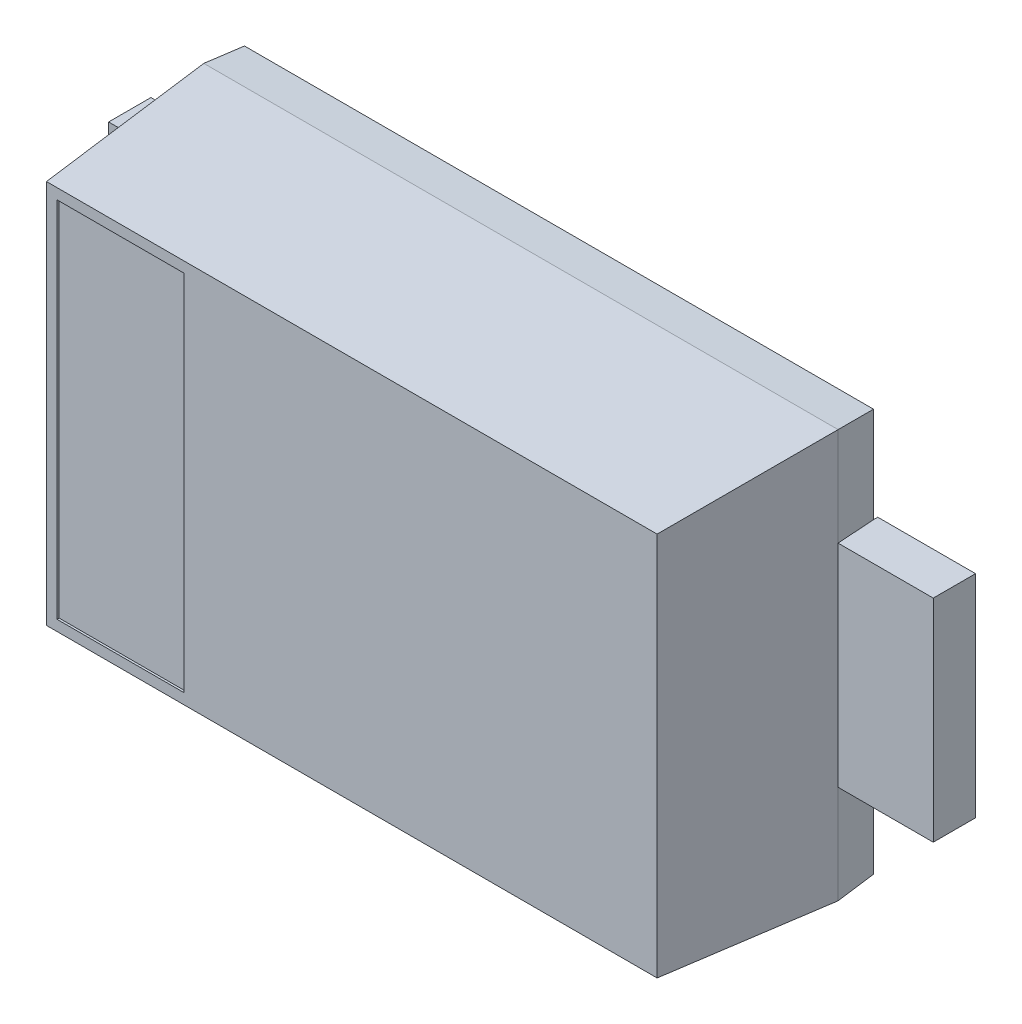
ISO-10303-21;
HEADER;
FILE_DESCRIPTION(('STEP AP214'),'2;1');
FILE_NAME('part.step','',(''),(''),'','','');
FILE_SCHEMA(('AUTOMOTIVE_DESIGN { 1 0 10303 214 1 1 1 1 }'));
ENDSEC;
DATA;
#1=APPLICATION_CONTEXT('core data for automotive mechanical design processes');
#2=APPLICATION_PROTOCOL_DEFINITION('international standard','automotive_design',2000,#1);
#3=PRODUCT_CONTEXT('',#1,'mechanical');
#4=PRODUCT('Part','Part','',(#3));
#5=PRODUCT_RELATED_PRODUCT_CATEGORY('part','',(#4));
#6=PRODUCT_DEFINITION_FORMATION('','',#4);
#7=PRODUCT_DEFINITION_CONTEXT('part definition',#1,'design');
#8=PRODUCT_DEFINITION('design','',#6,#7);
#9=PRODUCT_DEFINITION_SHAPE('','',#8);
#10=(LENGTH_UNIT() NAMED_UNIT(*) SI_UNIT(.MILLI.,.METRE.));
#11=(NAMED_UNIT(*) PLANE_ANGLE_UNIT() SI_UNIT($,.RADIAN.));
#12=(NAMED_UNIT(*) SI_UNIT($,.STERADIAN.) SOLID_ANGLE_UNIT());
#13=UNCERTAINTY_MEASURE_WITH_UNIT(LENGTH_MEASURE(1.E-05),#10,'distance_accuracy_value','');
#14=(GEOMETRIC_REPRESENTATION_CONTEXT(3) GLOBAL_UNCERTAINTY_ASSIGNED_CONTEXT((#13)) GLOBAL_UNIT_ASSIGNED_CONTEXT((#10,
#11,#12)) REPRESENTATION_CONTEXT('',''));
#15=CARTESIAN_POINT('',(0.,0.,0.));
#16=DIRECTION('',(0.,0.,1.));
#17=DIRECTION('',(1.,0.,0.));
#18=AXIS2_PLACEMENT_3D('',#15,#16,#17);
#19=CARTESIAN_POINT('',(-1.035765418923,0.,0.));
#20=DIRECTION('',(0.,0.,-1.));
#21=DIRECTION('',(-1.,0.,0.));
#22=AXIS2_PLACEMENT_3D('',#19,#20,#21);
#23=PLANE('',#22);
#24=DIRECTION('',(0.,1.,0.));
#25=VECTOR('',#24,1.);
#26=CARTESIAN_POINT('',(-0.13741317385,-0.55,0.));
#27=LINE('',#26,#25);
#28=CARTESIAN_POINT('',(-0.13741317385,-0.55,0.));
#29=VERTEX_POINT('',#28);
#30=CARTESIAN_POINT('',(-0.13741317385,0.55,0.));
#31=VERTEX_POINT('',#30);
#32=EDGE_CURVE('E306',#29,#31,#27,.T.);
#33=ORIENTED_EDGE('',*,*,#32,.F.);
#34=DIRECTION('',(1.,0.,0.));
#35=VECTOR('',#34,1.);
#36=CARTESIAN_POINT('',(-1.48741317385,-0.55,0.));
#37=LINE('',#36,#35);
#38=CARTESIAN_POINT('',(-1.48741317385,-0.55,0.));
#39=VERTEX_POINT('',#38);
#40=EDGE_CURVE('E307',#29,#39,#37,.F.);
#41=ORIENTED_EDGE('',*,*,#40,.T.);
#42=DIRECTION('',(0.,1.,0.));
#43=VECTOR('',#42,1.);
#44=CARTESIAN_POINT('',(-1.48741317385,0.,0.));
#45=LINE('',#44,#43);
#46=CARTESIAN_POINT('',(-1.48741317385,-0.5,0.));
#47=VERTEX_POINT('',#46);
#48=EDGE_CURVE('E336',#39,#47,#45,.T.);
#49=ORIENTED_EDGE('',*,*,#48,.T.);
#50=DIRECTION('',(-1.,0.,0.));
#51=VECTOR('',#50,1.);
#52=CARTESIAN_POINT('',(-1.035765418923,-0.5,0.));
#53=LINE('',#52,#51);
#54=CARTESIAN_POINT('',(-1.95,-0.5,0.));
#55=VERTEX_POINT('',#54);
#56=EDGE_CURVE('E327',#47,#55,#53,.T.);
#57=ORIENTED_EDGE('',*,*,#56,.T.);
#58=DIRECTION('',(0.,-1.,0.));
#59=VECTOR('',#58,1.);
#60=CARTESIAN_POINT('',(-1.95,0.5,0.));
#61=LINE('',#60,#59);
#62=CARTESIAN_POINT('',(-1.95,0.5,0.));
#63=VERTEX_POINT('',#62);
#64=EDGE_CURVE('E330',#63,#55,#61,.T.);
#65=ORIENTED_EDGE('',*,*,#64,.F.);
#66=DIRECTION('',(1.,0.,0.));
#67=VECTOR('',#66,1.);
#68=CARTESIAN_POINT('',(-1.48741317385,0.5,0.));
#69=LINE('',#68,#67);
#70=CARTESIAN_POINT('',(-1.48741317385,0.5,0.));
#71=VERTEX_POINT('',#70);
#72=EDGE_CURVE('E197',#63,#71,#69,.T.);
#73=ORIENTED_EDGE('',*,*,#72,.T.);
#74=DIRECTION('',(0.,1.,0.));
#75=VECTOR('',#74,1.);
#76=CARTESIAN_POINT('',(-1.48741317385,-0.55,0.));
#77=LINE('',#76,#75);
#78=CARTESIAN_POINT('',(-1.48741317385,0.55,0.));
#79=VERTEX_POINT('',#78);
#80=EDGE_CURVE('E193',#71,#79,#77,.T.);
#81=ORIENTED_EDGE('',*,*,#80,.T.);
#82=DIRECTION('',(1.,0.,0.));
#83=VECTOR('',#82,1.);
#84=CARTESIAN_POINT('',(-1.48741317385,0.55,0.));
#85=LINE('',#84,#83);
#86=EDGE_CURVE('E296',#31,#79,#85,.F.);
#87=ORIENTED_EDGE('',*,*,#86,.F.);
#88=EDGE_LOOP('',(#33,#41,#49,#57,#65,#73,#81,#87));
#89=FACE_BOUND('',#88,.T.);
#90=ADVANCED_FACE('F17',(#89),#23,.T.);
#91=CARTESIAN_POINT('',(-1.48741317385,-0.55,0.));
#92=DIRECTION('',(0.,1.,0.));
#93=DIRECTION('',(0.,0.,1.));
#94=AXIS2_PLACEMENT_3D('',#91,#92,#93);
#95=PLANE('',#94);
#96=DIRECTION('',(-1.,0.,0.));
#97=VECTOR('',#96,1.);
#98=CARTESIAN_POINT('',(-1.48741317385,-0.55,0.02));
#99=LINE('',#98,#97);
#100=CARTESIAN_POINT('',(-1.48741317385,-0.55,0.02));
#101=VERTEX_POINT('',#100);
#102=CARTESIAN_POINT('',(-0.13741317385,-0.55,0.02));
#103=VERTEX_POINT('',#102);
#104=EDGE_CURVE('E300',#101,#103,#99,.F.);
#105=ORIENTED_EDGE('',*,*,#104,.F.);
#106=DIRECTION('',(0.,0.,-1.));
#107=VECTOR('',#106,1.);
#108=CARTESIAN_POINT('',(-1.48741317385,-0.55,0.));
#109=LINE('',#108,#107);
#110=EDGE_CURVE('E314',#101,#39,#109,.T.);
#111=ORIENTED_EDGE('',*,*,#110,.T.);
#112=ORIENTED_EDGE('',*,*,#40,.F.);
#113=DIRECTION('',(0.,0.,-1.));
#114=VECTOR('',#113,1.);
#115=CARTESIAN_POINT('',(-0.13741317385,-0.55,0.));
#116=LINE('',#115,#114);
#117=EDGE_CURVE('E303',#103,#29,#116,.T.);
#118=ORIENTED_EDGE('',*,*,#117,.F.);
#119=EDGE_LOOP('',(#105,#111,#112,#118));
#120=FACE_BOUND('',#119,.T.);
#121=ADVANCED_FACE('F613',(#120),#95,.F.);
#122=CARTESIAN_POINT('',(-0.13741317385,-0.55,0.));
#123=DIRECTION('',(1.,0.,0.));
#124=DIRECTION('',(0.,0.,-1.));
#125=AXIS2_PLACEMENT_3D('',#122,#123,#124);
#126=PLANE('',#125);
#127=DIRECTION('',(0.,0.,1.));
#128=VECTOR('',#127,1.);
#129=CARTESIAN_POINT('',(-0.13741317385,0.55,0.));
#130=LINE('',#129,#128);
#131=CARTESIAN_POINT('',(-0.13741317385,0.55,0.02));
#132=VERTEX_POINT('',#131);
#133=EDGE_CURVE('E250',#132,#31,#130,.F.);
#134=ORIENTED_EDGE('',*,*,#133,.F.);
#135=DIRECTION('',(0.,1.,0.));
#136=VECTOR('',#135,1.);
#137=CARTESIAN_POINT('',(-0.13741317385,-0.95241317385,0.02));
#138=LINE('',#137,#136);
#139=EDGE_CURVE('E234',#103,#132,#138,.T.);
#140=ORIENTED_EDGE('',*,*,#139,.F.);
#141=ORIENTED_EDGE('',*,*,#117,.T.);
#142=ORIENTED_EDGE('',*,*,#32,.T.);
#143=EDGE_LOOP('',(#134,#140,#141,#142));
#144=FACE_BOUND('',#143,.T.);
#145=ADVANCED_FACE('F609',(#144),#126,.T.);
#146=CARTESIAN_POINT('',(-1.48741317385,0.55,0.));
#147=DIRECTION('',(0.,1.,0.));
#148=DIRECTION('',(0.,0.,1.));
#149=AXIS2_PLACEMENT_3D('',#146,#147,#148);
#150=PLANE('',#149);
#151=DIRECTION('',(-1.,0.,0.));
#152=VECTOR('',#151,1.);
#153=CARTESIAN_POINT('',(-1.48741317385,0.55,0.02));
#154=LINE('',#153,#152);
#155=CARTESIAN_POINT('',(-1.48741317385,0.55,0.02));
#156=VERTEX_POINT('',#155);
#157=EDGE_CURVE('E231',#132,#156,#154,.T.);
#158=ORIENTED_EDGE('',*,*,#157,.F.);
#159=ORIENTED_EDGE('',*,*,#133,.T.);
#160=ORIENTED_EDGE('',*,*,#86,.T.);
#161=DIRECTION('',(0.,0.,-1.));
#162=VECTOR('',#161,1.);
#163=CARTESIAN_POINT('',(-1.48741317385,0.55,0.));
#164=LINE('',#163,#162);
#165=EDGE_CURVE('E223',#79,#156,#164,.F.);
#166=ORIENTED_EDGE('',*,*,#165,.T.);
#167=EDGE_LOOP('',(#158,#159,#160,#166));
#168=FACE_BOUND('',#167,.T.);
#169=ADVANCED_FACE('F605',(#168),#150,.T.);
#170=CARTESIAN_POINT('',(1.48741317385,-0.5,0.));
#171=DIRECTION('',(0.,0.,1.));
#172=DIRECTION('',(1.,0.,0.));
#173=AXIS2_PLACEMENT_3D('',#170,#171,#172);
#174=PLANE('',#173);
#175=DIRECTION('',(0.,1.,0.));
#176=VECTOR('',#175,1.);
#177=CARTESIAN_POINT('',(1.95,-0.5,0.));
#178=LINE('',#177,#176);
#179=CARTESIAN_POINT('',(1.95,-0.5,0.));
#180=VERTEX_POINT('',#179);
#181=CARTESIAN_POINT('',(1.95,0.5,0.));
#182=VERTEX_POINT('',#181);
#183=EDGE_CURVE('E259',#180,#182,#178,.T.);
#184=ORIENTED_EDGE('',*,*,#183,.F.);
#185=DIRECTION('',(-1.,0.,0.));
#186=VECTOR('',#185,1.);
#187=CARTESIAN_POINT('',(1.48741317385,-0.5,0.));
#188=LINE('',#187,#186);
#189=CARTESIAN_POINT('',(1.48741317385,-0.5,0.));
#190=VERTEX_POINT('',#189);
#191=EDGE_CURVE('E264',#180,#190,#188,.T.);
#192=ORIENTED_EDGE('',*,*,#191,.T.);
#193=DIRECTION('',(0.,1.,0.));
#194=VECTOR('',#193,1.);
#195=CARTESIAN_POINT('',(1.48741317385,-0.5,0.));
#196=LINE('',#195,#194);
#197=CARTESIAN_POINT('',(1.48741317385,0.5,0.));
#198=VERTEX_POINT('',#197);
#199=EDGE_CURVE('E247',#190,#198,#196,.T.);
#200=ORIENTED_EDGE('',*,*,#199,.T.);
#201=DIRECTION('',(-1.,0.,0.));
#202=VECTOR('',#201,1.);
#203=CARTESIAN_POINT('',(1.48741317385,0.5,0.));
#204=LINE('',#203,#202);
#205=EDGE_CURVE('E253',#182,#198,#204,.T.);
#206=ORIENTED_EDGE('',*,*,#205,.F.);
#207=EDGE_LOOP('',(#184,#192,#200,#206));
#208=FACE_BOUND('',#207,.T.);
#209=ADVANCED_FACE('F602',(#208),#174,.F.);
#210=CARTESIAN_POINT('',(1.48741317385,-0.5,0.));
#211=DIRECTION('',(1.,0.,0.));
#212=DIRECTION('',(0.,1.,0.));
#213=AXIS2_PLACEMENT_3D('',#210,#211,#212);
#214=PLANE('',#213);
#215=DIRECTION('',(0.,0.,1.));
#216=VECTOR('',#215,1.);
#217=CARTESIAN_POINT('',(1.48741317385,0.5,0.));
#218=LINE('',#217,#216);
#219=CARTESIAN_POINT('',(1.48741317385,0.5,0.02));
#220=VERTEX_POINT('',#219);
#221=EDGE_CURVE('E255',#198,#220,#218,.T.);
#222=ORIENTED_EDGE('',*,*,#221,.F.);
#223=ORIENTED_EDGE('',*,*,#199,.F.);
#224=DIRECTION('',(0.,0.,1.));
#225=VECTOR('',#224,1.);
#226=CARTESIAN_POINT('',(1.48741317385,-0.5,0.));
#227=LINE('',#226,#225);
#228=CARTESIAN_POINT('',(1.48741317385,-0.5,0.02));
#229=VERTEX_POINT('',#228);
#230=EDGE_CURVE('E267',#190,#229,#227,.T.);
#231=ORIENTED_EDGE('',*,*,#230,.T.);
#232=DIRECTION('',(0.,1.,0.));
#233=VECTOR('',#232,1.);
#234=CARTESIAN_POINT('',(1.48741317385,-0.95241317385,0.02));
#235=LINE('',#234,#233);
#236=EDGE_CURVE('E271',#220,#229,#235,.F.);
#237=ORIENTED_EDGE('',*,*,#236,.F.);
#238=EDGE_LOOP('',(#222,#223,#231,#237));
#239=FACE_BOUND('',#238,.T.);
#240=ADVANCED_FACE('F466',(#239),#214,.F.);
#241=CARTESIAN_POINT('',(-1.48741317385,-0.55,0.));
#242=DIRECTION('',(1.,0.,0.));
#243=DIRECTION('',(0.,0.,-1.));
#244=AXIS2_PLACEMENT_3D('',#241,#242,#243);
#245=PLANE('',#244);
#246=ORIENTED_EDGE('',*,*,#80,.F.);
#247=DIRECTION('',(0.,0.,1.));
#248=VECTOR('',#247,1.);
#249=CARTESIAN_POINT('',(-1.48741317385,0.5,0.));
#250=LINE('',#249,#248);
#251=CARTESIAN_POINT('',(-1.48741317385,0.5,0.0200000000000003));
#252=VERTEX_POINT('',#251);
#253=EDGE_CURVE('E190',#71,#252,#250,.T.);
#254=ORIENTED_EDGE('',*,*,#253,.T.);
#255=DIRECTION('',(0.,-1.,0.));
#256=VECTOR('',#255,1.);
#257=CARTESIAN_POINT('',(-1.48741317385,0.,0.02));
#258=LINE('',#257,#256);
#259=EDGE_CURVE('E176',#156,#252,#258,.T.);
#260=ORIENTED_EDGE('',*,*,#259,.F.);
#261=ORIENTED_EDGE('',*,*,#165,.F.);
#262=EDGE_LOOP('',(#246,#254,#260,#261));
#263=FACE_BOUND('',#262,.T.);
#264=ADVANCED_FACE('F191',(#263),#245,.F.);
#265=CARTESIAN_POINT('',(-1.48741317385,0.5,0.));
#266=DIRECTION('',(0.,-1.,0.));
#267=DIRECTION('',(1.,0.,0.));
#268=AXIS2_PLACEMENT_3D('',#265,#266,#267);
#269=PLANE('',#268);
#270=DIRECTION('',(-0.0697564737450522,0.,0.997564050259759));
#271=VECTOR('',#270,1.);
#272=CARTESIAN_POINT('',(-1.48741317385,0.5,0.02));
#273=LINE('',#272,#271);
#274=CARTESIAN_POINT('',(-1.5,0.5,0.2));
#275=VERTEX_POINT('',#274);
#276=EDGE_CURVE('E21',#252,#275,#273,.T.);
#277=ORIENTED_EDGE('',*,*,#276,.F.);
#278=ORIENTED_EDGE('',*,*,#253,.F.);
#279=ORIENTED_EDGE('',*,*,#72,.F.);
#280=DIRECTION('',(0.,0.,1.));
#281=VECTOR('',#280,1.);
#282=CARTESIAN_POINT('',(-1.95,0.5,0.));
#283=LINE('',#282,#281);
#284=CARTESIAN_POINT('',(-1.95,0.5,0.2));
#285=VERTEX_POINT('',#284);
#286=EDGE_CURVE('E196',#285,#63,#283,.F.);
#287=ORIENTED_EDGE('',*,*,#286,.F.);
#288=DIRECTION('',(1.,0.,0.));
#289=VECTOR('',#288,1.);
#290=CARTESIAN_POINT('',(-1.48741317385,0.5,0.2));
#291=LINE('',#290,#289);
#292=EDGE_CURVE('E202',#275,#285,#291,.F.);
#293=ORIENTED_EDGE('',*,*,#292,.F.);
#294=EDGE_LOOP('',(#277,#278,#279,#287,#293));
#295=FACE_BOUND('',#294,.T.);
#296=ADVANCED_FACE('F200',(#295),#269,.F.);
#297=CARTESIAN_POINT('',(-1.95,0.5,0.));
#298=DIRECTION('',(-1.,0.,0.));
#299=DIRECTION('',(0.,-1.,0.));
#300=AXIS2_PLACEMENT_3D('',#297,#298,#299);
#301=PLANE('',#300);
#302=DIRECTION('',(0.,0.,1.));
#303=VECTOR('',#302,1.);
#304=CARTESIAN_POINT('',(-1.95,-0.5,0.));
#305=LINE('',#304,#303);
#306=CARTESIAN_POINT('',(-1.95,-0.5,0.2));
#307=VERTEX_POINT('',#306);
#308=EDGE_CURVE('E317',#307,#55,#305,.F.);
#309=ORIENTED_EDGE('',*,*,#308,.F.);
#310=DIRECTION('',(0.,1.,0.));
#311=VECTOR('',#310,1.);
#312=CARTESIAN_POINT('',(-1.95,0.5,0.2));
#313=LINE('',#312,#311);
#314=EDGE_CURVE('E204',#285,#307,#313,.F.);
#315=ORIENTED_EDGE('',*,*,#314,.F.);
#316=ORIENTED_EDGE('',*,*,#286,.T.);
#317=ORIENTED_EDGE('',*,*,#64,.T.);
#318=EDGE_LOOP('',(#309,#315,#316,#317));
#319=FACE_BOUND('',#318,.T.);
#320=ADVANCED_FACE('F392',(#319),#301,.T.);
#321=CARTESIAN_POINT('',(-1.48741317385,-0.5,0.));
#322=DIRECTION('',(0.,-1.,0.));
#323=DIRECTION('',(1.,0.,0.));
#324=AXIS2_PLACEMENT_3D('',#321,#322,#323);
#325=PLANE('',#324);
#326=DIRECTION('',(-0.0697564737450522,0.,0.997564050259759));
#327=VECTOR('',#326,1.);
#328=CARTESIAN_POINT('',(-1.48741317385,-0.5,0.02));
#329=LINE('',#328,#327);
#330=CARTESIAN_POINT('',(-1.5,-0.5,0.2));
#331=VERTEX_POINT('',#330);
#332=CARTESIAN_POINT('',(-1.48741317385,-0.5,0.02));
#333=VERTEX_POINT('',#332);
#334=EDGE_CURVE('E358',#331,#333,#329,.F.);
#335=ORIENTED_EDGE('',*,*,#334,.F.);
#336=DIRECTION('',(1.,0.,0.));
#337=VECTOR('',#336,1.);
#338=CARTESIAN_POINT('',(-1.48741317385,-0.5,0.2));
#339=LINE('',#338,#337);
#340=EDGE_CURVE('E207',#307,#331,#339,.T.);
#341=ORIENTED_EDGE('',*,*,#340,.F.);
#342=ORIENTED_EDGE('',*,*,#308,.T.);
#343=ORIENTED_EDGE('',*,*,#56,.F.);
#344=DIRECTION('',(0.,0.,-1.));
#345=VECTOR('',#344,1.);
#346=CARTESIAN_POINT('',(-1.48741317385,-0.5,0.));
#347=LINE('',#346,#345);
#348=EDGE_CURVE('E311',#47,#333,#347,.F.);
#349=ORIENTED_EDGE('',*,*,#348,.T.);
#350=EDGE_LOOP('',(#335,#341,#342,#343,#349));
#351=FACE_BOUND('',#350,.T.);
#352=ADVANCED_FACE('F398',(#351),#325,.T.);
#353=CARTESIAN_POINT('',(-1.48741317385,-0.55,0.));
#354=DIRECTION('',(1.,0.,0.));
#355=DIRECTION('',(0.,0.,-1.));
#356=AXIS2_PLACEMENT_3D('',#353,#354,#355);
#357=PLANE('',#356);
#358=ORIENTED_EDGE('',*,*,#48,.F.);
#359=ORIENTED_EDGE('',*,*,#110,.F.);
#360=DIRECTION('',(0.,-1.,0.));
#361=VECTOR('',#360,1.);
#362=CARTESIAN_POINT('',(-1.48741317385,0.,0.02));
#363=LINE('',#362,#361);
#364=EDGE_CURVE('E322',#333,#101,#363,.T.);
#365=ORIENTED_EDGE('',*,*,#364,.F.);
#366=ORIENTED_EDGE('',*,*,#348,.F.);
#367=EDGE_LOOP('',(#358,#359,#365,#366));
#368=FACE_BOUND('',#367,.T.);
#369=ADVANCED_FACE('F588',(#368),#357,.F.);
#370=CARTESIAN_POINT('',(-1.48741317385,-0.95241317385,0.02));
#371=DIRECTION('',(0.,0.,-1.));
#372=DIRECTION('',(-1.,0.,0.));
#373=AXIS2_PLACEMENT_3D('',#370,#371,#372);
#374=PLANE('',#373);
#375=ORIENTED_EDGE('',*,*,#236,.T.);
#376=DIRECTION('',(0.,1.,0.));
#377=VECTOR('',#376,1.);
#378=CARTESIAN_POINT('',(1.48741317385,-0.95241317385,0.02));
#379=LINE('',#378,#377);
#380=CARTESIAN_POINT('',(1.48741317385,-0.95241317385,0.02));
#381=VERTEX_POINT('',#380);
#382=EDGE_CURVE('E268',#229,#381,#379,.F.);
#383=ORIENTED_EDGE('',*,*,#382,.T.);
#384=DIRECTION('',(1.,0.,0.));
#385=VECTOR('',#384,1.);
#386=CARTESIAN_POINT('',(0.,-0.95241317385,0.02));
#387=LINE('',#386,#385);
#388=CARTESIAN_POINT('',(-1.48741317385,-0.95241317385,0.02));
#389=VERTEX_POINT('',#388);
#390=EDGE_CURVE('E228',#389,#381,#387,.T.);
#391=ORIENTED_EDGE('',*,*,#390,.F.);
#392=DIRECTION('',(0.,-1.,0.));
#393=VECTOR('',#392,1.);
#394=CARTESIAN_POINT('',(-1.48741317385,0.,0.02));
#395=LINE('',#394,#393);
#396=EDGE_CURVE('E320',#101,#389,#395,.T.);
#397=ORIENTED_EDGE('',*,*,#396,.F.);
#398=ORIENTED_EDGE('',*,*,#104,.T.);
#399=ORIENTED_EDGE('',*,*,#139,.T.);
#400=ORIENTED_EDGE('',*,*,#157,.T.);
#401=DIRECTION('',(0.,-1.,0.));
#402=VECTOR('',#401,1.);
#403=CARTESIAN_POINT('',(-1.48741317385,0.,0.02));
#404=LINE('',#403,#402);
#405=CARTESIAN_POINT('',(-1.48741317385,0.95241317385,0.02));
#406=VERTEX_POINT('',#405);
#407=EDGE_CURVE('E184',#406,#156,#404,.T.);
#408=ORIENTED_EDGE('',*,*,#407,.F.);
#409=DIRECTION('',(-1.,0.,0.));
#410=VECTOR('',#409,1.);
#411=CARTESIAN_POINT('',(0.,0.95241317385,0.02));
#412=LINE('',#411,#410);
#413=CARTESIAN_POINT('',(1.48741317385,0.95241317385,0.02));
#414=VERTEX_POINT('',#413);
#415=EDGE_CURVE('E237',#414,#406,#412,.T.);
#416=ORIENTED_EDGE('',*,*,#415,.F.);
#417=DIRECTION('',(0.,1.,0.));
#418=VECTOR('',#417,1.);
#419=CARTESIAN_POINT('',(1.48741317385,-0.95241317385,0.02));
#420=LINE('',#419,#418);
#421=EDGE_CURVE('E233',#414,#220,#420,.F.);
#422=ORIENTED_EDGE('',*,*,#421,.T.);
#423=EDGE_LOOP('',(#375,#383,#391,#397,#398,#399,#400,#408,#416,#422));
#424=FACE_BOUND('',#423,.T.);
#425=ADVANCED_FACE('F474',(#424),#374,.T.);
#426=CARTESIAN_POINT('',(1.48741317385,-0.5,0.));
#427=DIRECTION('',(0.,1.,0.));
#428=DIRECTION('',(-1.,0.,0.));
#429=AXIS2_PLACEMENT_3D('',#426,#427,#428);
#430=PLANE('',#429);
#431=DIRECTION('',(0.0697564737450522,0.,0.997564050259759));
#432=VECTOR('',#431,1.);
#433=CARTESIAN_POINT('',(1.48741317385,-0.5,0.02));
#434=LINE('',#433,#432);
#435=CARTESIAN_POINT('',(1.5,-0.5,0.2));
#436=VERTEX_POINT('',#435);
#437=EDGE_CURVE('E282',#229,#436,#434,.T.);
#438=ORIENTED_EDGE('',*,*,#437,.F.);
#439=ORIENTED_EDGE('',*,*,#230,.F.);
#440=ORIENTED_EDGE('',*,*,#191,.F.);
#441=DIRECTION('',(0.,0.,1.));
#442=VECTOR('',#441,1.);
#443=CARTESIAN_POINT('',(1.95,-0.5,0.));
#444=LINE('',#443,#442);
#445=CARTESIAN_POINT('',(1.95,-0.5,0.2));
#446=VERTEX_POINT('',#445);
#447=EDGE_CURVE('E261',#446,#180,#444,.F.);
#448=ORIENTED_EDGE('',*,*,#447,.F.);
#449=DIRECTION('',(1.,0.,0.));
#450=VECTOR('',#449,1.);
#451=CARTESIAN_POINT('',(1.48741317385,-0.5,0.2));
#452=LINE('',#451,#450);
#453=EDGE_CURVE('E357',#436,#446,#452,.T.);
#454=ORIENTED_EDGE('',*,*,#453,.F.);
#455=EDGE_LOOP('',(#438,#439,#440,#448,#454));
#456=FACE_BOUND('',#455,.T.);
#457=ADVANCED_FACE('F478',(#456),#430,.F.);
#458=CARTESIAN_POINT('',(1.95,-0.5,0.));
#459=DIRECTION('',(1.,0.,0.));
#460=DIRECTION('',(0.,1.,0.));
#461=AXIS2_PLACEMENT_3D('',#458,#459,#460);
#462=PLANE('',#461);
#463=DIRECTION('',(0.,0.,1.));
#464=VECTOR('',#463,1.);
#465=CARTESIAN_POINT('',(1.95,0.5,0.));
#466=LINE('',#465,#464);
#467=CARTESIAN_POINT('',(1.95,0.5,0.2));
#468=VERTEX_POINT('',#467);
#469=EDGE_CURVE('E256',#468,#182,#466,.F.);
#470=ORIENTED_EDGE('',*,*,#469,.F.);
#471=DIRECTION('',(0.,1.,0.));
#472=VECTOR('',#471,1.);
#473=CARTESIAN_POINT('',(1.95,-0.5,0.2));
#474=LINE('',#473,#472);
#475=EDGE_CURVE('E433',#446,#468,#474,.T.);
#476=ORIENTED_EDGE('',*,*,#475,.F.);
#477=ORIENTED_EDGE('',*,*,#447,.T.);
#478=ORIENTED_EDGE('',*,*,#183,.T.);
#479=EDGE_LOOP('',(#470,#476,#477,#478));
#480=FACE_BOUND('',#479,.T.);
#481=ADVANCED_FACE('F580',(#480),#462,.T.);
#482=CARTESIAN_POINT('',(1.48741317385,0.5,0.));
#483=DIRECTION('',(0.,1.,0.));
#484=DIRECTION('',(-1.,0.,0.));
#485=AXIS2_PLACEMENT_3D('',#482,#483,#484);
#486=PLANE('',#485);
#487=DIRECTION('',(0.0697564737450522,0.,0.997564050259759));
#488=VECTOR('',#487,1.);
#489=CARTESIAN_POINT('',(1.48741317385,0.5,0.02));
#490=LINE('',#489,#488);
#491=CARTESIAN_POINT('',(1.5,0.5,0.2));
#492=VERTEX_POINT('',#491);
#493=EDGE_CURVE('E291',#492,#220,#490,.F.);
#494=ORIENTED_EDGE('',*,*,#493,.F.);
#495=DIRECTION('',(1.,0.,0.));
#496=VECTOR('',#495,1.);
#497=CARTESIAN_POINT('',(1.48741317385,0.5,0.2));
#498=LINE('',#497,#496);
#499=EDGE_CURVE('E356',#468,#492,#498,.F.);
#500=ORIENTED_EDGE('',*,*,#499,.F.);
#501=ORIENTED_EDGE('',*,*,#469,.T.);
#502=ORIENTED_EDGE('',*,*,#205,.T.);
#503=ORIENTED_EDGE('',*,*,#221,.T.);
#504=EDGE_LOOP('',(#494,#500,#501,#502,#503));
#505=FACE_BOUND('',#504,.T.);
#506=ADVANCED_FACE('F491',(#505),#486,.T.);
#507=CARTESIAN_POINT('',(-1.48741317385,-0.95241317385,0.02));
#508=DIRECTION('',(0.,-0.997564050259759,-0.0697564737450522));
#509=DIRECTION('',(1.,0.,0.));
#510=AXIS2_PLACEMENT_3D('',#507,#508,#509);
#511=PLANE('',#510);
#512=DIRECTION('',(1.,0.,0.));
#513=VECTOR('',#512,1.);
#514=CARTESIAN_POINT('',(0.,-0.965,0.2));
#515=LINE('',#514,#513);
#516=CARTESIAN_POINT('',(-1.5,-0.965,0.2));
#517=VERTEX_POINT('',#516);
#518=CARTESIAN_POINT('',(1.5,-0.965,0.2));
#519=VERTEX_POINT('',#518);
#520=EDGE_CURVE('E217',#517,#519,#515,.T.);
#521=ORIENTED_EDGE('',*,*,#520,.F.);
#522=DIRECTION('',(-0.0695873743175849,-0.0695873743175849,0.99514581578338));
#523=VECTOR('',#522,1.);
#524=CARTESIAN_POINT('',(-1.493706586925,-0.958706586925,0.11));
#525=LINE('',#524,#523);
#526=EDGE_CURVE('E240',#389,#517,#525,.T.);
#527=ORIENTED_EDGE('',*,*,#526,.F.);
#528=ORIENTED_EDGE('',*,*,#390,.T.);
#529=DIRECTION('',(-0.0695873743175849,0.0695873743175849,-0.99514581578338));
#530=VECTOR('',#529,1.);
#531=CARTESIAN_POINT('',(1.493706586925,-0.958706586925,0.11));
#532=LINE('',#531,#530);
#533=EDGE_CURVE('E244',#519,#381,#532,.T.);
#534=ORIENTED_EDGE('',*,*,#533,.F.);
#535=EDGE_LOOP('',(#521,#527,#528,#534));
#536=FACE_BOUND('',#535,.T.);
#537=ADVANCED_FACE('F410',(#536),#511,.T.);
#538=CARTESIAN_POINT('',(-1.48741317385,0.95241317385,0.02));
#539=DIRECTION('',(-0.997564050259759,0.,-0.0697564737450522));
#540=DIRECTION('',(0.,-1.,0.));
#541=AXIS2_PLACEMENT_3D('',#538,#539,#540);
#542=PLANE('',#541);
#543=ORIENTED_EDGE('',*,*,#276,.T.);
#544=DIRECTION('',(0.,-1.,0.));
#545=VECTOR('',#544,1.);
#546=CARTESIAN_POINT('',(-1.5,0.,0.2));
#547=LINE('',#546,#545);
#548=CARTESIAN_POINT('',(-1.5,0.965,0.2));
#549=VERTEX_POINT('',#548);
#550=EDGE_CURVE('E215',#549,#275,#547,.T.);
#551=ORIENTED_EDGE('',*,*,#550,.F.);
#552=DIRECTION('',(-0.0695873743175849,0.0695873743175849,0.99514581578338));
#553=VECTOR('',#552,1.);
#554=CARTESIAN_POINT('',(-1.493706586925,0.958706586925,0.11));
#555=LINE('',#554,#553);
#556=EDGE_CURVE('E239',#406,#549,#555,.T.);
#557=ORIENTED_EDGE('',*,*,#556,.F.);
#558=ORIENTED_EDGE('',*,*,#407,.T.);
#559=ORIENTED_EDGE('',*,*,#259,.T.);
#560=EDGE_LOOP('',(#543,#551,#557,#558,#559));
#561=FACE_BOUND('',#560,.T.);
#562=ADVANCED_FACE('F178',(#561),#542,.T.);
#563=CARTESIAN_POINT('',(-1.48741317385,0.5,0.2));
#564=DIRECTION('',(0.,0.,1.));
#565=DIRECTION('',(1.,0.,0.));
#566=AXIS2_PLACEMENT_3D('',#563,#564,#565);
#567=PLANE('',#566);
#568=ORIENTED_EDGE('',*,*,#314,.T.);
#569=ORIENTED_EDGE('',*,*,#340,.T.);
#570=DIRECTION('',(0.,-1.,0.));
#571=VECTOR('',#570,1.);
#572=CARTESIAN_POINT('',(-1.5,0.,0.2));
#573=LINE('',#572,#571);
#574=EDGE_CURVE('E216',#275,#331,#573,.T.);
#575=ORIENTED_EDGE('',*,*,#574,.F.);
#576=ORIENTED_EDGE('',*,*,#292,.T.);
#577=EDGE_LOOP('',(#568,#569,#575,#576));
#578=FACE_BOUND('',#577,.T.);
#579=ADVANCED_FACE('F575',(#578),#567,.T.);
#580=CARTESIAN_POINT('',(-1.48741317385,0.95241317385,0.02));
#581=DIRECTION('',(-0.997564050259759,0.,-0.0697564737450522));
#582=DIRECTION('',(0.,-1.,0.));
#583=AXIS2_PLACEMENT_3D('',#580,#581,#582);
#584=PLANE('',#583);
#585=ORIENTED_EDGE('',*,*,#526,.T.);
#586=DIRECTION('',(0.,-1.,0.));
#587=VECTOR('',#586,1.);
#588=CARTESIAN_POINT('',(-1.5,0.,0.2));
#589=LINE('',#588,#587);
#590=EDGE_CURVE('E373',#331,#517,#589,.T.);
#591=ORIENTED_EDGE('',*,*,#590,.F.);
#592=ORIENTED_EDGE('',*,*,#334,.T.);
#593=ORIENTED_EDGE('',*,*,#364,.T.);
#594=ORIENTED_EDGE('',*,*,#396,.T.);
#595=EDGE_LOOP('',(#585,#591,#592,#593,#594));
#596=FACE_BOUND('',#595,.T.);
#597=ADVANCED_FACE('F400',(#596),#584,.T.);
#598=CARTESIAN_POINT('',(1.48741317385,0.95241317385,0.02));
#599=DIRECTION('',(0.,0.997564050259759,-0.0697564737450522));
#600=DIRECTION('',(-1.,0.,0.));
#601=AXIS2_PLACEMENT_3D('',#598,#599,#600);
#602=PLANE('',#601);
#603=DIRECTION('',(-1.,0.,0.));
#604=VECTOR('',#603,1.);
#605=CARTESIAN_POINT('',(0.,0.965,0.2));
#606=LINE('',#605,#604);
#607=CARTESIAN_POINT('',(1.5,0.965,0.2));
#608=VERTEX_POINT('',#607);
#609=EDGE_CURVE('E418',#608,#549,#606,.T.);
#610=ORIENTED_EDGE('',*,*,#609,.F.);
#611=DIRECTION('',(0.0695873743175849,0.0695873743175849,0.99514581578338));
#612=VECTOR('',#611,1.);
#613=CARTESIAN_POINT('',(1.493706586925,0.958706586925,0.11));
#614=LINE('',#613,#612);
#615=EDGE_CURVE('E288',#414,#608,#614,.T.);
#616=ORIENTED_EDGE('',*,*,#615,.F.);
#617=ORIENTED_EDGE('',*,*,#415,.T.);
#618=ORIENTED_EDGE('',*,*,#556,.T.);
#619=EDGE_LOOP('',(#610,#616,#617,#618));
#620=FACE_BOUND('',#619,.T.);
#621=ADVANCED_FACE('F496',(#620),#602,.T.);
#622=CARTESIAN_POINT('',(1.48741317385,-0.95241317385,0.02));
#623=DIRECTION('',(0.997564050259759,0.,-0.0697564737450522));
#624=DIRECTION('',(0.,1.,0.));
#625=AXIS2_PLACEMENT_3D('',#622,#623,#624);
#626=PLANE('',#625);
#627=ORIENTED_EDGE('',*,*,#437,.T.);
#628=DIRECTION('',(0.,1.,0.));
#629=VECTOR('',#628,1.);
#630=CARTESIAN_POINT('',(1.5,0.,0.2));
#631=LINE('',#630,#629);
#632=EDGE_CURVE('E431',#519,#436,#631,.T.);
#633=ORIENTED_EDGE('',*,*,#632,.F.);
#634=ORIENTED_EDGE('',*,*,#533,.T.);
#635=ORIENTED_EDGE('',*,*,#382,.F.);
#636=EDGE_LOOP('',(#627,#633,#634,#635));
#637=FACE_BOUND('',#636,.T.);
#638=ADVANCED_FACE('F470',(#637),#626,.T.);
#639=CARTESIAN_POINT('',(1.48741317385,-0.5,0.2));
#640=DIRECTION('',(0.,0.,1.));
#641=DIRECTION('',(1.,0.,0.));
#642=AXIS2_PLACEMENT_3D('',#639,#640,#641);
#643=PLANE('',#642);
#644=ORIENTED_EDGE('',*,*,#475,.T.);
#645=ORIENTED_EDGE('',*,*,#499,.T.);
#646=DIRECTION('',(0.,1.,0.));
#647=VECTOR('',#646,1.);
#648=CARTESIAN_POINT('',(1.5,0.,0.2));
#649=LINE('',#648,#647);
#650=EDGE_CURVE('E427',#436,#492,#649,.T.);
#651=ORIENTED_EDGE('',*,*,#650,.F.);
#652=ORIENTED_EDGE('',*,*,#453,.T.);
#653=EDGE_LOOP('',(#644,#645,#651,#652));
#654=FACE_BOUND('',#653,.T.);
#655=ADVANCED_FACE('F483',(#654),#643,.T.);
#656=CARTESIAN_POINT('',(1.48741317385,-0.95241317385,0.02));
#657=DIRECTION('',(0.997564050259759,0.,-0.0697564737450522));
#658=DIRECTION('',(0.,1.,0.));
#659=AXIS2_PLACEMENT_3D('',#656,#657,#658);
#660=PLANE('',#659);
#661=ORIENTED_EDGE('',*,*,#615,.T.);
#662=DIRECTION('',(0.,1.,0.));
#663=VECTOR('',#662,1.);
#664=CARTESIAN_POINT('',(1.5,0.,0.2));
#665=LINE('',#664,#663);
#666=EDGE_CURVE('E430',#492,#608,#665,.T.);
#667=ORIENTED_EDGE('',*,*,#666,.F.);
#668=ORIENTED_EDGE('',*,*,#493,.T.);
#669=ORIENTED_EDGE('',*,*,#421,.F.);
#670=EDGE_LOOP('',(#661,#667,#668,#669));
#671=FACE_BOUND('',#670,.T.);
#672=ADVANCED_FACE('F493',(#671),#660,.T.);
#673=CARTESIAN_POINT('',(-1.394058550445,-0.859058550445,0.99));
#674=DIRECTION('',(0.,0.,1.));
#675=DIRECTION('',(1.,0.,0.));
#676=AXIS2_PLACEMENT_3D('',#673,#674,#675);
#677=PLANE('',#676);
#678=DIRECTION('',(0.,1.,0.));
#679=VECTOR('',#678,1.);
#680=CARTESIAN_POINT('',(-0.794058550445,-0.859058550445,0.99));
#681=LINE('',#680,#679);
#682=CARTESIAN_POINT('',(-0.794058550445,-0.859058550445,0.99));
#683=VERTEX_POINT('',#682);
#684=CARTESIAN_POINT('',(-0.794058550445,0.859058550445,0.99));
#685=VERTEX_POINT('',#684);
#686=EDGE_CURVE('E506',#683,#685,#681,.T.);
#687=ORIENTED_EDGE('',*,*,#686,.T.);
#688=DIRECTION('',(1.,0.,0.));
#689=VECTOR('',#688,1.);
#690=CARTESIAN_POINT('',(-1.394058550445,0.859058550445,0.99));
#691=LINE('',#690,#689);
#692=CARTESIAN_POINT('',(-1.394058550445,0.859058550445,0.99));
#693=VERTEX_POINT('',#692);
#694=EDGE_CURVE('E527',#685,#693,#691,.F.);
#695=ORIENTED_EDGE('',*,*,#694,.T.);
#696=DIRECTION('',(0.,1.,0.));
#697=VECTOR('',#696,1.);
#698=CARTESIAN_POINT('',(-1.394058550445,-0.859058550445,0.99));
#699=LINE('',#698,#697);
#700=CARTESIAN_POINT('',(-1.394058550445,-0.859058550445,0.99));
#701=VERTEX_POINT('',#700);
#702=EDGE_CURVE('E525',#701,#693,#699,.T.);
#703=ORIENTED_EDGE('',*,*,#702,.F.);
#704=DIRECTION('',(1.,0.,0.));
#705=VECTOR('',#704,1.);
#706=CARTESIAN_POINT('',(-1.394058550445,-0.859058550445,0.99));
#707=LINE('',#706,#705);
#708=EDGE_CURVE('E290',#701,#683,#707,.T.);
#709=ORIENTED_EDGE('',*,*,#708,.T.);
#710=EDGE_LOOP('',(#687,#695,#703,#709));
#711=FACE_BOUND('',#710,.T.);
#712=ADVANCED_FACE('F535',(#711),#677,.T.);
#713=CARTESIAN_POINT('',(-1.5,-0.965,0.2));
#714=DIRECTION('',(0.,-0.997564050259808,0.0697564737443633));
#715=DIRECTION('',(1.,0.,0.));
#716=AXIS2_PLACEMENT_3D('',#713,#714,#715);
#717=PLANE('',#716);
#718=DIRECTION('',(-1.,0.,0.));
#719=VECTOR('',#718,1.);
#720=CARTESIAN_POINT('',(-1.444058550445,-0.909058550445,1.));
#721=LINE('',#720,#719);
#722=CARTESIAN_POINT('',(1.444058550445,-0.909058550445,1.));
#723=VERTEX_POINT('',#722);
#724=CARTESIAN_POINT('',(-1.444058550445,-0.909058550445,1.));
#725=VERTEX_POINT('',#724);
#726=EDGE_CURVE('E417',#723,#725,#721,.T.);
#727=ORIENTED_EDGE('',*,*,#726,.T.);
#728=DIRECTION('',(0.0695873743169007,0.0695873743169009,0.995145815783476));
#729=VECTOR('',#728,1.);
#730=CARTESIAN_POINT('',(-1.4720292752225,-0.9370292752225,0.6));
#731=LINE('',#730,#729);
#732=EDGE_CURVE('E376',#517,#725,#731,.T.);
#733=ORIENTED_EDGE('',*,*,#732,.F.);
#734=ORIENTED_EDGE('',*,*,#520,.T.);
#735=DIRECTION('',(0.0695873743169007,-0.0695873743169009,-0.995145815783476));
#736=VECTOR('',#735,1.);
#737=CARTESIAN_POINT('',(1.4720292752225,-0.9370292752225,0.6));
#738=LINE('',#737,#736);
#739=EDGE_CURVE('E504',#723,#519,#738,.T.);
#740=ORIENTED_EDGE('',*,*,#739,.F.);
#741=EDGE_LOOP('',(#727,#733,#734,#740));
#742=FACE_BOUND('',#741,.T.);
#743=ADVANCED_FACE('F416',(#742),#717,.T.);
#744=CARTESIAN_POINT('',(-1.5,0.965,0.2));
#745=DIRECTION('',(-0.997564050259808,0.,0.069756473744363));
#746=DIRECTION('',(0.,-1.,0.));
#747=AXIS2_PLACEMENT_3D('',#744,#745,#746);
#748=PLANE('',#747);
#749=DIRECTION('',(0.,1.,0.));
#750=VECTOR('',#749,1.);
#751=CARTESIAN_POINT('',(-1.444058550445,-0.909058550445,1.));
#752=LINE('',#751,#750);
#753=CARTESIAN_POINT('',(-1.444058550445,0.909058550445,1.));
#754=VERTEX_POINT('',#753);
#755=EDGE_CURVE('E512',#725,#754,#752,.T.);
#756=ORIENTED_EDGE('',*,*,#755,.T.);
#757=DIRECTION('',(0.0695873743169007,-0.0695873743169009,0.995145815783476));
#758=VECTOR('',#757,1.);
#759=CARTESIAN_POINT('',(-1.4720292752225,0.9370292752225,0.6));
#760=LINE('',#759,#758);
#761=EDGE_CURVE('E421',#549,#754,#760,.T.);
#762=ORIENTED_EDGE('',*,*,#761,.F.);
#763=ORIENTED_EDGE('',*,*,#550,.T.);
#764=ORIENTED_EDGE('',*,*,#574,.T.);
#765=ORIENTED_EDGE('',*,*,#590,.T.);
#766=ORIENTED_EDGE('',*,*,#732,.T.);
#767=EDGE_LOOP('',(#756,#762,#763,#764,#765,#766));
#768=FACE_BOUND('',#767,.T.);
#769=ADVANCED_FACE('F405',(#768),#748,.T.);
#770=CARTESIAN_POINT('',(1.5,0.965,0.2));
#771=DIRECTION('',(0.,0.997564050259808,0.0697564737443633));
#772=DIRECTION('',(-1.,0.,0.));
#773=AXIS2_PLACEMENT_3D('',#770,#771,#772);
#774=PLANE('',#773);
#775=DIRECTION('',(-1.,0.,0.));
#776=VECTOR('',#775,1.);
#777=CARTESIAN_POINT('',(-1.444058550445,0.909058550445,1.));
#778=LINE('',#777,#776);
#779=CARTESIAN_POINT('',(1.444058550445,0.909058550445,1.));
#780=VERTEX_POINT('',#779);
#781=EDGE_CURVE('E502',#754,#780,#778,.F.);
#782=ORIENTED_EDGE('',*,*,#781,.T.);
#783=DIRECTION('',(-0.0695873743169007,-0.0695873743169009,0.995145815783476));
#784=VECTOR('',#783,1.);
#785=CARTESIAN_POINT('',(1.4720292752225,0.9370292752225,0.6));
#786=LINE('',#785,#784);
#787=EDGE_CURVE('E438',#608,#780,#786,.T.);
#788=ORIENTED_EDGE('',*,*,#787,.F.);
#789=ORIENTED_EDGE('',*,*,#609,.T.);
#790=ORIENTED_EDGE('',*,*,#761,.T.);
#791=EDGE_LOOP('',(#782,#788,#789,#790));
#792=FACE_BOUND('',#791,.T.);
#793=ADVANCED_FACE('F500',(#792),#774,.T.);
#794=CARTESIAN_POINT('',(1.5,-0.965,0.2));
#795=DIRECTION('',(0.997564050259808,0.,0.069756473744363));
#796=DIRECTION('',(0.,1.,0.));
#797=AXIS2_PLACEMENT_3D('',#794,#795,#796);
#798=PLANE('',#797);
#799=DIRECTION('',(0.,1.,0.));
#800=VECTOR('',#799,1.);
#801=CARTESIAN_POINT('',(1.444058550445,-0.909058550445,1.));
#802=LINE('',#801,#800);
#803=EDGE_CURVE('E513',#780,#723,#802,.F.);
#804=ORIENTED_EDGE('',*,*,#803,.T.);
#805=ORIENTED_EDGE('',*,*,#739,.T.);
#806=ORIENTED_EDGE('',*,*,#632,.T.);
#807=ORIENTED_EDGE('',*,*,#650,.T.);
#808=ORIENTED_EDGE('',*,*,#666,.T.);
#809=ORIENTED_EDGE('',*,*,#787,.T.);
#810=EDGE_LOOP('',(#804,#805,#806,#807,#808,#809));
#811=FACE_BOUND('',#810,.T.);
#812=ADVANCED_FACE('F19',(#811),#798,.T.);
#813=CARTESIAN_POINT('',(-0.794058550445,-0.859058550445,0.99));
#814=DIRECTION('',(1.,0.,0.));
#815=DIRECTION('',(0.,0.,-1.));
#816=AXIS2_PLACEMENT_3D('',#813,#814,#815);
#817=PLANE('',#816);
#818=DIRECTION('',(0.,0.,1.));
#819=VECTOR('',#818,1.);
#820=CARTESIAN_POINT('',(-0.794058550445,0.859058550445,0.99));
#821=LINE('',#820,#819);
#822=CARTESIAN_POINT('',(-0.794058550445,0.859058550445,1.));
#823=VERTEX_POINT('',#822);
#824=EDGE_CURVE('E530',#823,#685,#821,.F.);
#825=ORIENTED_EDGE('',*,*,#824,.T.);
#826=ORIENTED_EDGE('',*,*,#686,.F.);
#827=DIRECTION('',(0.,0.,1.));
#828=VECTOR('',#827,1.);
#829=CARTESIAN_POINT('',(-0.794058550445,-0.859058550445,0.99));
#830=LINE('',#829,#828);
#831=CARTESIAN_POINT('',(-0.794058550445,-0.859058550445,1.));
#832=VERTEX_POINT('',#831);
#833=EDGE_CURVE('E520',#832,#683,#830,.F.);
#834=ORIENTED_EDGE('',*,*,#833,.F.);
#835=DIRECTION('',(0.,1.,0.));
#836=VECTOR('',#835,1.);
#837=CARTESIAN_POINT('',(-0.794058550445,-0.909058550445,1.));
#838=LINE('',#837,#836);
#839=EDGE_CURVE('E546',#832,#823,#838,.T.);
#840=ORIENTED_EDGE('',*,*,#839,.T.);
#841=EDGE_LOOP('',(#825,#826,#834,#840));
#842=FACE_BOUND('',#841,.T.);
#843=ADVANCED_FACE('F545',(#842),#817,.F.);
#844=CARTESIAN_POINT('',(-1.394058550445,0.859058550445,0.99));
#845=DIRECTION('',(0.,1.,0.));
#846=DIRECTION('',(0.,0.,1.));
#847=AXIS2_PLACEMENT_3D('',#844,#845,#846);
#848=PLANE('',#847);
#849=DIRECTION('',(0.,0.,-1.));
#850=VECTOR('',#849,1.);
#851=CARTESIAN_POINT('',(-1.394058550445,0.859058550445,0.99));
#852=LINE('',#851,#850);
#853=CARTESIAN_POINT('',(-1.394058550445,0.859058550445,1.));
#854=VERTEX_POINT('',#853);
#855=EDGE_CURVE('E523',#693,#854,#852,.F.);
#856=ORIENTED_EDGE('',*,*,#855,.F.);
#857=ORIENTED_EDGE('',*,*,#694,.F.);
#858=ORIENTED_EDGE('',*,*,#824,.F.);
#859=DIRECTION('',(-1.,0.,0.));
#860=VECTOR('',#859,1.);
#861=CARTESIAN_POINT('',(-1.444058550445,0.859058550445,1.));
#862=LINE('',#861,#860);
#863=EDGE_CURVE('E548',#823,#854,#862,.T.);
#864=ORIENTED_EDGE('',*,*,#863,.T.);
#865=EDGE_LOOP('',(#856,#857,#858,#864));
#866=FACE_BOUND('',#865,.T.);
#867=ADVANCED_FACE('F541',(#866),#848,.F.);
#868=CARTESIAN_POINT('',(-1.394058550445,-0.859058550445,0.99));
#869=DIRECTION('',(1.,0.,0.));
#870=DIRECTION('',(0.,0.,-1.));
#871=AXIS2_PLACEMENT_3D('',#868,#869,#870);
#872=PLANE('',#871);
#873=ORIENTED_EDGE('',*,*,#855,.T.);
#874=DIRECTION('',(0.,1.,0.));
#875=VECTOR('',#874,1.);
#876=CARTESIAN_POINT('',(-1.394058550445,-0.909058550445,1.));
#877=LINE('',#876,#875);
#878=CARTESIAN_POINT('',(-1.394058550445,-0.859058550445,1.));
#879=VERTEX_POINT('',#878);
#880=EDGE_CURVE('E27',#854,#879,#877,.F.);
#881=ORIENTED_EDGE('',*,*,#880,.T.);
#882=DIRECTION('',(0.,0.,1.));
#883=VECTOR('',#882,1.);
#884=CARTESIAN_POINT('',(-1.394058550445,-0.859058550445,0.99));
#885=LINE('',#884,#883);
#886=EDGE_CURVE('E35',#701,#879,#885,.T.);
#887=ORIENTED_EDGE('',*,*,#886,.F.);
#888=ORIENTED_EDGE('',*,*,#702,.T.);
#889=EDGE_LOOP('',(#873,#881,#887,#888));
#890=FACE_BOUND('',#889,.T.);
#891=ADVANCED_FACE('F555',(#890),#872,.T.);
#892=CARTESIAN_POINT('',(-1.394058550445,-0.859058550445,0.99));
#893=DIRECTION('',(0.,1.,0.));
#894=DIRECTION('',(0.,0.,1.));
#895=AXIS2_PLACEMENT_3D('',#892,#893,#894);
#896=PLANE('',#895);
#897=ORIENTED_EDGE('',*,*,#886,.T.);
#898=DIRECTION('',(-1.,0.,0.));
#899=VECTOR('',#898,1.);
#900=CARTESIAN_POINT('',(-1.444058550445,-0.859058550445,1.));
#901=LINE('',#900,#899);
#902=EDGE_CURVE('E11',#879,#832,#901,.F.);
#903=ORIENTED_EDGE('',*,*,#902,.T.);
#904=ORIENTED_EDGE('',*,*,#833,.T.);
#905=ORIENTED_EDGE('',*,*,#708,.F.);
#906=EDGE_LOOP('',(#897,#903,#904,#905));
#907=FACE_BOUND('',#906,.T.);
#908=ADVANCED_FACE('F556',(#907),#896,.T.);
#909=CARTESIAN_POINT('',(-1.444058550445,-0.909058550445,1.));
#910=DIRECTION('',(0.,0.,-1.));
#911=DIRECTION('',(-1.,0.,0.));
#912=AXIS2_PLACEMENT_3D('',#909,#910,#911);
#913=PLANE('',#912);
#914=ORIENTED_EDGE('',*,*,#880,.F.);
#915=ORIENTED_EDGE('',*,*,#863,.F.);
#916=ORIENTED_EDGE('',*,*,#839,.F.);
#917=ORIENTED_EDGE('',*,*,#902,.F.);
#918=EDGE_LOOP('',(#914,#915,#916,#917));
#919=FACE_BOUND('',#918,.T.);
#920=ORIENTED_EDGE('',*,*,#781,.F.);
#921=ORIENTED_EDGE('',*,*,#755,.F.);
#922=ORIENTED_EDGE('',*,*,#726,.F.);
#923=ORIENTED_EDGE('',*,*,#803,.F.);
#924=EDGE_LOOP('',(#920,#921,#922,#923));
#925=FACE_BOUND('',#924,.T.);
#926=ADVANCED_FACE('F511',(#919,#925),#913,.F.);
#927=CLOSED_SHELL('',(#90,#121,#145,#169,#209,#240,#264,#296,#320,#352,#369,#425,#457,#481,#506,
#537,#562,#579,#597,#621,#638,#655,#672,#712,#743,#769,#793,#812,#843,#867,#891,#908,#926));
#928=MANIFOLD_SOLID_BREP('B1',#927);
#929=ADVANCED_BREP_SHAPE_REPRESENTATION('',(#18,#928),#14);
#930=SHAPE_DEFINITION_REPRESENTATION(#9,#929);
ENDSEC;
END-ISO-10303-21;
